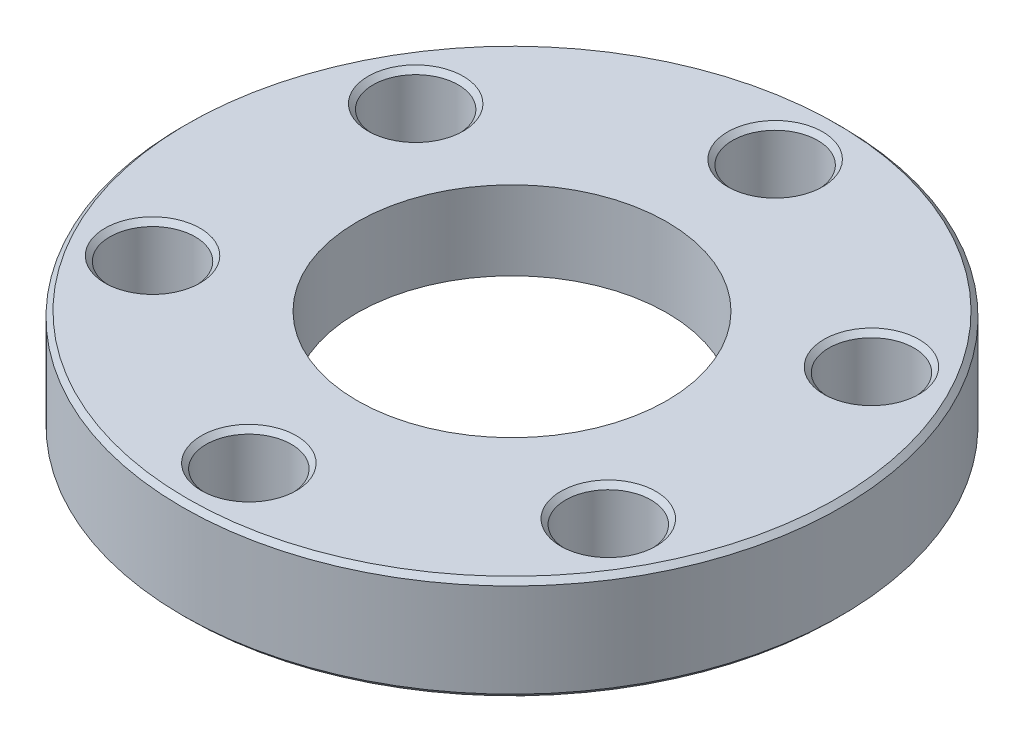
ISO-10303-21;
HEADER;
FILE_DESCRIPTION(('STEP AP214'),'2;1');
FILE_NAME('part.step','',(''),(''),'','','');
FILE_SCHEMA(('AUTOMOTIVE_DESIGN { 1 0 10303 214 1 1 1 1 }'));
ENDSEC;
DATA;
#1=APPLICATION_CONTEXT('core data for automotive mechanical design processes');
#2=APPLICATION_PROTOCOL_DEFINITION('international standard','automotive_design',2000,#1);
#3=PRODUCT_CONTEXT('',#1,'mechanical');
#4=PRODUCT('Part','Part','',(#3));
#5=PRODUCT_RELATED_PRODUCT_CATEGORY('part','',(#4));
#6=PRODUCT_DEFINITION_FORMATION('','',#4);
#7=PRODUCT_DEFINITION_CONTEXT('part definition',#1,'design');
#8=PRODUCT_DEFINITION('design','',#6,#7);
#9=PRODUCT_DEFINITION_SHAPE('','',#8);
#10=(LENGTH_UNIT() NAMED_UNIT(*) SI_UNIT(.MILLI.,.METRE.));
#11=(NAMED_UNIT(*) PLANE_ANGLE_UNIT() SI_UNIT($,.RADIAN.));
#12=(NAMED_UNIT(*) SI_UNIT($,.STERADIAN.) SOLID_ANGLE_UNIT());
#13=UNCERTAINTY_MEASURE_WITH_UNIT(LENGTH_MEASURE(1.E-05),#10,'distance_accuracy_value','');
#14=(GEOMETRIC_REPRESENTATION_CONTEXT(3) GLOBAL_UNCERTAINTY_ASSIGNED_CONTEXT((#13)) GLOBAL_UNIT_ASSIGNED_CONTEXT((#10,
#11,#12)) REPRESENTATION_CONTEXT('',''));
#15=CARTESIAN_POINT('',(0.,0.,0.));
#16=DIRECTION('',(0.,0.,1.));
#17=DIRECTION('',(1.,0.,0.));
#18=AXIS2_PLACEMENT_3D('',#15,#16,#17);
#19=CARTESIAN_POINT('',(0.,12.7,0.));
#20=DIRECTION('',(0.,-1.,0.));
#21=DIRECTION('',(0.,0.,-1.));
#22=AXIS2_PLACEMENT_3D('',#19,#20,#21);
#23=CYLINDRICAL_SURFACE('',#22,16.891);
#24=CARTESIAN_POINT('',(0.,5.05460000000001,0.));
#25=DIRECTION('',(0.,1.,0.));
#26=DIRECTION('',(0.,0.,1.));
#27=AXIS2_PLACEMENT_3D('',#24,#25,#26);
#28=CIRCLE('',#27,16.891);
#29=CARTESIAN_POINT('',(0.,5.05460000000001,16.891));
#30=VERTEX_POINT('',#29);
#31=EDGE_CURVE('E118',#30,#30,#28,.F.);
#32=ORIENTED_EDGE('',*,*,#31,.T.);
#33=EDGE_LOOP('',(#32));
#34=FACE_BOUND('',#33,.T.);
#35=CARTESIAN_POINT('',(0.,0.254000000000001,0.));
#36=DIRECTION('',(0.,1.,0.));
#37=DIRECTION('',(0.,0.,1.));
#38=AXIS2_PLACEMENT_3D('',#35,#36,#37);
#39=CIRCLE('',#38,16.891);
#40=CARTESIAN_POINT('',(0.,0.254000000000001,16.891));
#41=VERTEX_POINT('',#40);
#42=EDGE_CURVE('E121',#41,#41,#39,.T.);
#43=ORIENTED_EDGE('',*,*,#42,.T.);
#44=EDGE_LOOP('',(#43));
#45=FACE_BOUND('',#44,.T.);
#46=ADVANCED_FACE('F30',(#34,#45),#23,.T.);
#47=CARTESIAN_POINT('',(0.,12.7,0.));
#48=DIRECTION('',(0.,-1.,0.));
#49=DIRECTION('',(0.,0.,-1.));
#50=AXIS2_PLACEMENT_3D('',#47,#48,#49);
#51=CYLINDRICAL_SURFACE('',#50,7.9375);
#52=CARTESIAN_POINT('',(0.,1.27,0.));
#53=DIRECTION('',(0.,1.,0.));
#54=DIRECTION('',(0.,0.,1.));
#55=AXIS2_PLACEMENT_3D('',#52,#53,#54);
#56=CIRCLE('',#55,7.9375);
#57=CARTESIAN_POINT('',(0.,1.27,7.9375));
#58=VERTEX_POINT('',#57);
#59=EDGE_CURVE('E111',#58,#58,#56,.T.);
#60=ORIENTED_EDGE('',*,*,#59,.F.);
#61=EDGE_LOOP('',(#60));
#62=FACE_BOUND('',#61,.T.);
#63=CARTESIAN_POINT('',(0.,5.3086,0.));
#64=DIRECTION('',(0.,1.,0.));
#65=DIRECTION('',(0.,0.,1.));
#66=AXIS2_PLACEMENT_3D('',#63,#64,#65);
#67=CIRCLE('',#66,7.9375);
#68=CARTESIAN_POINT('',(0.,5.3086,7.9375));
#69=VERTEX_POINT('',#68);
#70=EDGE_CURVE('E114',#69,#69,#67,.T.);
#71=ORIENTED_EDGE('',*,*,#70,.T.);
#72=EDGE_LOOP('',(#71));
#73=FACE_BOUND('',#72,.T.);
#74=ADVANCED_FACE('F176',(#62,#73),#51,.F.);
#75=CARTESIAN_POINT('',(0.,0.,0.));
#76=DIRECTION('',(0.,1.,0.));
#77=DIRECTION('',(0.,0.,1.));
#78=AXIS2_PLACEMENT_3D('',#75,#76,#77);
#79=PLANE('',#78);
#80=CARTESIAN_POINT('',(-11.6804310310022,0.,-6.74370000000014));
#81=DIRECTION('',(0.,1.,0.));
#82=DIRECTION('',(0.,0.,1.));
#83=AXIS2_PLACEMENT_3D('',#80,#81,#82);
#84=CIRCLE('',#83,2.43839999999997);
#85=CARTESIAN_POINT('',(-11.6804310310022,0.,-4.30530000000017));
#86=VERTEX_POINT('',#85);
#87=EDGE_CURVE('E10',#86,#86,#84,.T.);
#88=ORIENTED_EDGE('',*,*,#87,.T.);
#89=EDGE_LOOP('',(#88));
#90=FACE_BOUND('',#89,.T.);
#91=CARTESIAN_POINT('',(-11.6804310310023,0.,6.74369999999989));
#92=DIRECTION('',(0.,1.,0.));
#93=DIRECTION('',(0.,0.,1.));
#94=AXIS2_PLACEMENT_3D('',#91,#92,#93);
#95=CIRCLE('',#94,2.43839999999997);
#96=CARTESIAN_POINT('',(-11.6804310310023,0.,9.18209999999986));
#97=VERTEX_POINT('',#96);
#98=EDGE_CURVE('E50',#97,#97,#95,.T.);
#99=ORIENTED_EDGE('',*,*,#98,.T.);
#100=EDGE_LOOP('',(#99));
#101=FACE_BOUND('',#100,.T.);
#102=CARTESIAN_POINT('',(0.,0.,13.4874));
#103=DIRECTION('',(0.,1.,0.));
#104=DIRECTION('',(0.,0.,1.));
#105=AXIS2_PLACEMENT_3D('',#102,#103,#104);
#106=CIRCLE('',#105,2.43839999999998);
#107=CARTESIAN_POINT('',(0.,0.,15.9258));
#108=VERTEX_POINT('',#107);
#109=EDGE_CURVE('E62',#108,#108,#106,.T.);
#110=ORIENTED_EDGE('',*,*,#109,.T.);
#111=EDGE_LOOP('',(#110));
#112=FACE_BOUND('',#111,.T.);
#113=CARTESIAN_POINT('',(11.6804310310022,0.,6.74370000000006));
#114=DIRECTION('',(0.,1.,0.));
#115=DIRECTION('',(0.,0.,1.));
#116=AXIS2_PLACEMENT_3D('',#113,#114,#115);
#117=CIRCLE('',#116,2.43839999999998);
#118=CARTESIAN_POINT('',(11.6804310310022,0.,9.18210000000003));
#119=VERTEX_POINT('',#118);
#120=EDGE_CURVE('E74',#119,#119,#117,.T.);
#121=ORIENTED_EDGE('',*,*,#120,.T.);
#122=EDGE_LOOP('',(#121));
#123=FACE_BOUND('',#122,.T.);
#124=CARTESIAN_POINT('',(11.6804310310023,0.,-6.74369999999997));
#125=DIRECTION('',(0.,1.,0.));
#126=DIRECTION('',(0.,0.,1.));
#127=AXIS2_PLACEMENT_3D('',#124,#125,#126);
#128=CIRCLE('',#127,2.43839999999997);
#129=CARTESIAN_POINT('',(11.6804310310023,0.,-4.3053));
#130=VERTEX_POINT('',#129);
#131=EDGE_CURVE('E86',#130,#130,#128,.T.);
#132=ORIENTED_EDGE('',*,*,#131,.T.);
#133=EDGE_LOOP('',(#132));
#134=FACE_BOUND('',#133,.T.);
#135=CARTESIAN_POINT('',(0.,0.,-13.4874));
#136=DIRECTION('',(0.,1.,0.));
#137=DIRECTION('',(0.,0.,1.));
#138=AXIS2_PLACEMENT_3D('',#135,#136,#137);
#139=CIRCLE('',#138,2.43839999999998);
#140=CARTESIAN_POINT('',(0.,0.,-11.049));
#141=VERTEX_POINT('',#140);
#142=EDGE_CURVE('E98',#141,#141,#139,.T.);
#143=ORIENTED_EDGE('',*,*,#142,.T.);
#144=EDGE_LOOP('',(#143));
#145=FACE_BOUND('',#144,.T.);
#146=CARTESIAN_POINT('',(0.,0.,0.));
#147=DIRECTION('',(0.,1.,0.));
#148=DIRECTION('',(0.,0.,1.));
#149=AXIS2_PLACEMENT_3D('',#146,#147,#148);
#150=CIRCLE('',#149,10.7188);
#151=CARTESIAN_POINT('',(0.,0.,10.7188));
#152=VERTEX_POINT('',#151);
#153=EDGE_CURVE('E137',#152,#152,#150,.T.);
#154=ORIENTED_EDGE('',*,*,#153,.T.);
#155=EDGE_LOOP('',(#154));
#156=FACE_BOUND('',#155,.T.);
#157=CARTESIAN_POINT('',(0.,0.,0.));
#158=DIRECTION('',(0.,1.,0.));
#159=DIRECTION('',(0.,0.,1.));
#160=AXIS2_PLACEMENT_3D('',#157,#158,#159);
#161=CIRCLE('',#160,16.637);
#162=CARTESIAN_POINT('',(0.,0.,16.637));
#163=VERTEX_POINT('',#162);
#164=EDGE_CURVE('E110',#163,#163,#161,.F.);
#165=ORIENTED_EDGE('',*,*,#164,.T.);
#166=EDGE_LOOP('',(#165));
#167=FACE_BOUND('',#166,.T.);
#168=ADVANCED_FACE('F141',(#90,#101,#112,#123,#134,#145,#156,#167),#79,.F.);
#169=CARTESIAN_POINT('',(0.,5.3086,0.));
#170=DIRECTION('',(0.,1.,0.));
#171=DIRECTION('',(0.,0.,1.));
#172=AXIS2_PLACEMENT_3D('',#169,#170,#171);
#173=PLANE('',#172);
#174=CARTESIAN_POINT('',(-11.6804310310022,5.3086,-6.74370000000014));
#175=DIRECTION('',(0.,1.,0.));
#176=DIRECTION('',(0.,0.,1.));
#177=AXIS2_PLACEMENT_3D('',#174,#175,#176);
#178=CIRCLE('',#177,2.43840000000002);
#179=CARTESIAN_POINT('',(-11.6804310310022,5.3086,-4.30530000000011));
#180=VERTEX_POINT('',#179);
#181=EDGE_CURVE('E37',#180,#180,#178,.F.);
#182=ORIENTED_EDGE('',*,*,#181,.T.);
#183=EDGE_LOOP('',(#182));
#184=FACE_BOUND('',#183,.T.);
#185=CARTESIAN_POINT('',(-11.6804310310023,5.3086,6.74369999999989));
#186=DIRECTION('',(0.,1.,0.));
#187=DIRECTION('',(0.,0.,1.));
#188=AXIS2_PLACEMENT_3D('',#185,#186,#187);
#189=CIRCLE('',#188,2.43840000000002);
#190=CARTESIAN_POINT('',(-11.6804310310023,5.3086,9.18209999999991));
#191=VERTEX_POINT('',#190);
#192=EDGE_CURVE('E53',#191,#191,#189,.F.);
#193=ORIENTED_EDGE('',*,*,#192,.T.);
#194=EDGE_LOOP('',(#193));
#195=FACE_BOUND('',#194,.T.);
#196=CARTESIAN_POINT('',(0.,5.3086,13.4874));
#197=DIRECTION('',(0.,1.,0.));
#198=DIRECTION('',(0.,0.,1.));
#199=AXIS2_PLACEMENT_3D('',#196,#197,#198);
#200=CIRCLE('',#199,2.43840000000001);
#201=CARTESIAN_POINT('',(0.,5.3086,15.9258));
#202=VERTEX_POINT('',#201);
#203=EDGE_CURVE('E65',#202,#202,#200,.F.);
#204=ORIENTED_EDGE('',*,*,#203,.T.);
#205=EDGE_LOOP('',(#204));
#206=FACE_BOUND('',#205,.T.);
#207=CARTESIAN_POINT('',(11.6804310310022,5.3086,6.74370000000006));
#208=DIRECTION('',(0.,1.,0.));
#209=DIRECTION('',(0.,0.,1.));
#210=AXIS2_PLACEMENT_3D('',#207,#208,#209);
#211=CIRCLE('',#210,2.43840000000003);
#212=CARTESIAN_POINT('',(11.6804310310022,5.3086,9.18210000000009));
#213=VERTEX_POINT('',#212);
#214=EDGE_CURVE('E77',#213,#213,#211,.F.);
#215=ORIENTED_EDGE('',*,*,#214,.T.);
#216=EDGE_LOOP('',(#215));
#217=FACE_BOUND('',#216,.T.);
#218=CARTESIAN_POINT('',(11.6804310310023,5.3086,-6.74369999999997));
#219=DIRECTION('',(0.,1.,0.));
#220=DIRECTION('',(0.,0.,1.));
#221=AXIS2_PLACEMENT_3D('',#218,#219,#220);
#222=CIRCLE('',#221,2.43840000000002);
#223=CARTESIAN_POINT('',(11.6804310310023,5.3086,-4.30529999999995));
#224=VERTEX_POINT('',#223);
#225=EDGE_CURVE('E89',#224,#224,#222,.F.);
#226=ORIENTED_EDGE('',*,*,#225,.T.);
#227=EDGE_LOOP('',(#226));
#228=FACE_BOUND('',#227,.T.);
#229=CARTESIAN_POINT('',(0.,5.3086,-13.4874));
#230=DIRECTION('',(0.,1.,0.));
#231=DIRECTION('',(0.,0.,1.));
#232=AXIS2_PLACEMENT_3D('',#229,#230,#231);
#233=CIRCLE('',#232,2.43840000000001);
#234=CARTESIAN_POINT('',(0.,5.3086,-11.049));
#235=VERTEX_POINT('',#234);
#236=EDGE_CURVE('E101',#235,#235,#233,.F.);
#237=ORIENTED_EDGE('',*,*,#236,.T.);
#238=EDGE_LOOP('',(#237));
#239=FACE_BOUND('',#238,.T.);
#240=CARTESIAN_POINT('',(0.,5.3086,0.));
#241=DIRECTION('',(0.,1.,0.));
#242=DIRECTION('',(0.,0.,1.));
#243=AXIS2_PLACEMENT_3D('',#240,#241,#242);
#244=CIRCLE('',#243,16.637);
#245=CARTESIAN_POINT('',(0.,5.3086,16.637));
#246=VERTEX_POINT('',#245);
#247=EDGE_CURVE('E124',#246,#246,#244,.T.);
#248=ORIENTED_EDGE('',*,*,#247,.T.);
#249=EDGE_LOOP('',(#248));
#250=FACE_BOUND('',#249,.T.);
#251=ORIENTED_EDGE('',*,*,#70,.F.);
#252=EDGE_LOOP('',(#251));
#253=FACE_BOUND('',#252,.T.);
#254=ADVANCED_FACE('F188',(#184,#195,#206,#217,#228,#239,#250,#253),#173,.T.);
#255=CARTESIAN_POINT('',(0.,5.3086,0.));
#256=DIRECTION('',(0.,-1.,0.));
#257=DIRECTION('',(0.,0.,-1.));
#258=AXIS2_PLACEMENT_3D('',#255,#256,#257);
#259=CONICAL_SURFACE('',#258,16.637,0.785398163397455);
#260=ORIENTED_EDGE('',*,*,#31,.F.);
#261=EDGE_LOOP('',(#260));
#262=FACE_BOUND('',#261,.T.);
#263=ORIENTED_EDGE('',*,*,#247,.F.);
#264=EDGE_LOOP('',(#263));
#265=FACE_BOUND('',#264,.T.);
#266=ADVANCED_FACE('F171',(#262,#265),#259,.T.);
#267=CARTESIAN_POINT('',(0.,0.254000000000001,0.));
#268=DIRECTION('',(0.,1.,0.));
#269=DIRECTION('',(0.,0.,1.));
#270=AXIS2_PLACEMENT_3D('',#267,#268,#269);
#271=CONICAL_SURFACE('',#270,16.891,0.785398163397448);
#272=ORIENTED_EDGE('',*,*,#164,.F.);
#273=EDGE_LOOP('',(#272));
#274=FACE_BOUND('',#273,.T.);
#275=ORIENTED_EDGE('',*,*,#42,.F.);
#276=EDGE_LOOP('',(#275));
#277=FACE_BOUND('',#276,.T.);
#278=ADVANCED_FACE('F165',(#274,#277),#271,.T.);
#279=CARTESIAN_POINT('',(-9.144,1.27,0.));
#280=DIRECTION('',(0.,1.,0.));
#281=DIRECTION('',(0.,0.,1.));
#282=AXIS2_PLACEMENT_3D('',#279,#280,#281);
#283=PLANE('',#282);
#284=ORIENTED_EDGE('',*,*,#59,.T.);
#285=EDGE_LOOP('',(#284));
#286=FACE_BOUND('',#285,.T.);
#287=CARTESIAN_POINT('',(0.,1.27,0.));
#288=DIRECTION('',(0.,1.,0.));
#289=DIRECTION('',(0.,0.,1.));
#290=AXIS2_PLACEMENT_3D('',#287,#288,#289);
#291=CIRCLE('',#290,9.144);
#292=CARTESIAN_POINT('',(0.,1.27,9.144));
#293=VERTEX_POINT('',#292);
#294=EDGE_CURVE('E115',#293,#293,#291,.T.);
#295=ORIENTED_EDGE('',*,*,#294,.F.);
#296=EDGE_LOOP('',(#295));
#297=FACE_BOUND('',#296,.T.);
#298=ADVANCED_FACE('F160',(#286,#297),#283,.F.);
#299=CARTESIAN_POINT('',(0.,5.3086,0.));
#300=DIRECTION('',(0.,1.,0.));
#301=DIRECTION('',(0.,0.,1.));
#302=AXIS2_PLACEMENT_3D('',#299,#300,#301);
#303=CYLINDRICAL_SURFACE('',#302,9.144);
#304=CARTESIAN_POINT('',(0.,0.6604,0.));
#305=DIRECTION('',(0.,1.,0.));
#306=DIRECTION('',(0.,0.,1.));
#307=AXIS2_PLACEMENT_3D('',#304,#305,#306);
#308=CIRCLE('',#307,9.144);
#309=CARTESIAN_POINT('',(0.,0.6604,9.144));
#310=VERTEX_POINT('',#309);
#311=EDGE_CURVE('E131',#310,#310,#308,.T.);
#312=ORIENTED_EDGE('',*,*,#311,.F.);
#313=EDGE_LOOP('',(#312));
#314=FACE_BOUND('',#313,.T.);
#315=ORIENTED_EDGE('',*,*,#294,.T.);
#316=EDGE_LOOP('',(#315));
#317=FACE_BOUND('',#316,.T.);
#318=ADVANCED_FACE('F154',(#314,#317),#303,.F.);
#319=CARTESIAN_POINT('',(0.,0.6604,0.));
#320=DIRECTION('',(0.,1.,0.));
#321=DIRECTION('',(0.,0.,1.));
#322=AXIS2_PLACEMENT_3D('',#319,#320,#321);
#323=CONICAL_SURFACE('',#322,9.144,1.21556546474821);
#324=CARTESIAN_POINT('',(0.,1.2446,0.));
#325=DIRECTION('',(0.,1.,0.));
#326=DIRECTION('',(0.,0.,1.));
#327=AXIS2_PLACEMENT_3D('',#324,#325,#326);
#328=CIRCLE('',#327,10.7188);
#329=CARTESIAN_POINT('',(0.,1.2446,10.7188));
#330=VERTEX_POINT('',#329);
#331=EDGE_CURVE('E134',#330,#330,#328,.T.);
#332=ORIENTED_EDGE('',*,*,#331,.F.);
#333=EDGE_LOOP('',(#332));
#334=FACE_BOUND('',#333,.T.);
#335=ORIENTED_EDGE('',*,*,#311,.T.);
#336=EDGE_LOOP('',(#335));
#337=FACE_BOUND('',#336,.T.);
#338=ADVANCED_FACE('F148',(#334,#337),#323,.T.);
#339=CARTESIAN_POINT('',(0.,5.3086,0.));
#340=DIRECTION('',(0.,1.,0.));
#341=DIRECTION('',(0.,0.,1.));
#342=AXIS2_PLACEMENT_3D('',#339,#340,#341);
#343=CYLINDRICAL_SURFACE('',#342,10.7188);
#344=ORIENTED_EDGE('',*,*,#153,.F.);
#345=EDGE_LOOP('',(#344));
#346=FACE_BOUND('',#345,.T.);
#347=ORIENTED_EDGE('',*,*,#331,.T.);
#348=EDGE_LOOP('',(#347));
#349=FACE_BOUND('',#348,.T.);
#350=ADVANCED_FACE('F144',(#346,#349),#343,.F.);
#351=CARTESIAN_POINT('',(0.,0.,-13.4874));
#352=DIRECTION('',(0.,1.,0.));
#353=DIRECTION('',(0.,0.,1.));
#354=AXIS2_PLACEMENT_3D('',#351,#352,#353);
#355=CYLINDRICAL_SURFACE('',#354,2.1844);
#356=CARTESIAN_POINT('',(0.,5.05459999999999,-13.4874));
#357=DIRECTION('',(0.,1.,0.));
#358=DIRECTION('',(0.,0.,1.));
#359=AXIS2_PLACEMENT_3D('',#356,#357,#358);
#360=CIRCLE('',#359,2.1844);
#361=CARTESIAN_POINT('',(0.,5.05459999999999,-11.303));
#362=VERTEX_POINT('',#361);
#363=EDGE_CURVE('E104',#362,#362,#360,.T.);
#364=ORIENTED_EDGE('',*,*,#363,.T.);
#365=EDGE_LOOP('',(#364));
#366=FACE_BOUND('',#365,.T.);
#367=CARTESIAN_POINT('',(0.,0.25399999999998,-13.4874));
#368=DIRECTION('',(0.,1.,0.));
#369=DIRECTION('',(0.,0.,1.));
#370=AXIS2_PLACEMENT_3D('',#367,#368,#369);
#371=CIRCLE('',#370,2.1844);
#372=CARTESIAN_POINT('',(0.,0.25399999999998,-11.303));
#373=VERTEX_POINT('',#372);
#374=EDGE_CURVE('E107',#373,#373,#371,.F.);
#375=ORIENTED_EDGE('',*,*,#374,.T.);
#376=EDGE_LOOP('',(#375));
#377=FACE_BOUND('',#376,.T.);
#378=ADVANCED_FACE('F147',(#366,#377),#355,.F.);
#379=CARTESIAN_POINT('',(0.,5.05459999999999,-13.4874));
#380=DIRECTION('',(0.,1.,0.));
#381=DIRECTION('',(0.,0.,1.));
#382=AXIS2_PLACEMENT_3D('',#379,#380,#381);
#383=CONICAL_SURFACE('',#382,2.1844,0.785398163397448);
#384=ORIENTED_EDGE('',*,*,#236,.F.);
#385=EDGE_LOOP('',(#384));
#386=FACE_BOUND('',#385,.T.);
#387=ORIENTED_EDGE('',*,*,#363,.F.);
#388=EDGE_LOOP('',(#387));
#389=FACE_BOUND('',#388,.T.);
#390=ADVANCED_FACE('F191',(#386,#389),#383,.F.);
#391=CARTESIAN_POINT('',(0.,0.,-13.4874));
#392=DIRECTION('',(0.,-1.,0.));
#393=DIRECTION('',(0.,0.,-1.));
#394=AXIS2_PLACEMENT_3D('',#391,#392,#393);
#395=CONICAL_SURFACE('',#394,2.43839999999998,0.785398163397448);
#396=ORIENTED_EDGE('',*,*,#374,.F.);
#397=EDGE_LOOP('',(#396));
#398=FACE_BOUND('',#397,.T.);
#399=ORIENTED_EDGE('',*,*,#142,.F.);
#400=EDGE_LOOP('',(#399));
#401=FACE_BOUND('',#400,.T.);
#402=ADVANCED_FACE('F194',(#398,#401),#395,.F.);
#403=CARTESIAN_POINT('',(11.6804310310023,0.,-6.74369999999997));
#404=DIRECTION('',(0.,1.,0.));
#405=DIRECTION('',(0.,0.,1.));
#406=AXIS2_PLACEMENT_3D('',#403,#404,#405);
#407=CYLINDRICAL_SURFACE('',#406,2.1844);
#408=CARTESIAN_POINT('',(11.6804310310023,5.05459999999998,-6.74369999999997));
#409=DIRECTION('',(0.,1.,0.));
#410=DIRECTION('',(0.,0.,1.));
#411=AXIS2_PLACEMENT_3D('',#408,#409,#410);
#412=CIRCLE('',#411,2.1844);
#413=CARTESIAN_POINT('',(11.6804310310023,5.05459999999998,-4.55929999999997));
#414=VERTEX_POINT('',#413);
#415=EDGE_CURVE('E92',#414,#414,#412,.T.);
#416=ORIENTED_EDGE('',*,*,#415,.T.);
#417=EDGE_LOOP('',(#416));
#418=FACE_BOUND('',#417,.T.);
#419=CARTESIAN_POINT('',(11.6804310310023,0.253999999999966,-6.74369999999997));
#420=DIRECTION('',(0.,1.,0.));
#421=DIRECTION('',(0.,0.,1.));
#422=AXIS2_PLACEMENT_3D('',#419,#420,#421);
#423=CIRCLE('',#422,2.1844);
#424=CARTESIAN_POINT('',(11.6804310310023,0.253999999999966,-4.55929999999997));
#425=VERTEX_POINT('',#424);
#426=EDGE_CURVE('E95',#425,#425,#423,.F.);
#427=ORIENTED_EDGE('',*,*,#426,.T.);
#428=EDGE_LOOP('',(#427));
#429=FACE_BOUND('',#428,.T.);
#430=ADVANCED_FACE('F198',(#418,#429),#407,.F.);
#431=CARTESIAN_POINT('',(11.6804310310022,0.,6.74370000000006));
#432=DIRECTION('',(0.,1.,0.));
#433=DIRECTION('',(0.,0.,1.));
#434=AXIS2_PLACEMENT_3D('',#431,#432,#433);
#435=CYLINDRICAL_SURFACE('',#434,2.1844);
#436=CARTESIAN_POINT('',(11.6804310310022,5.05459999999997,6.74370000000006));
#437=DIRECTION('',(0.,1.,0.));
#438=DIRECTION('',(0.,0.,1.));
#439=AXIS2_PLACEMENT_3D('',#436,#437,#438);
#440=CIRCLE('',#439,2.1844);
#441=CARTESIAN_POINT('',(11.6804310310022,5.05459999999997,8.92810000000006));
#442=VERTEX_POINT('',#441);
#443=EDGE_CURVE('E80',#442,#442,#440,.T.);
#444=ORIENTED_EDGE('',*,*,#443,.T.);
#445=EDGE_LOOP('',(#444));
#446=FACE_BOUND('',#445,.T.);
#447=CARTESIAN_POINT('',(11.6804310310022,0.25399999999998,6.74370000000006));
#448=DIRECTION('',(0.,1.,0.));
#449=DIRECTION('',(0.,0.,1.));
#450=AXIS2_PLACEMENT_3D('',#447,#448,#449);
#451=CIRCLE('',#450,2.1844);
#452=CARTESIAN_POINT('',(11.6804310310022,0.25399999999998,8.92810000000006));
#453=VERTEX_POINT('',#452);
#454=EDGE_CURVE('E83',#453,#453,#451,.F.);
#455=ORIENTED_EDGE('',*,*,#454,.T.);
#456=EDGE_LOOP('',(#455));
#457=FACE_BOUND('',#456,.T.);
#458=ADVANCED_FACE('F257',(#446,#457),#435,.F.);
#459=CARTESIAN_POINT('',(0.,0.,13.4874));
#460=DIRECTION('',(0.,1.,0.));
#461=DIRECTION('',(0.,0.,1.));
#462=AXIS2_PLACEMENT_3D('',#459,#460,#461);
#463=CYLINDRICAL_SURFACE('',#462,2.1844);
#464=CARTESIAN_POINT('',(0.,5.05459999999999,13.4874));
#465=DIRECTION('',(0.,1.,0.));
#466=DIRECTION('',(0.,0.,1.));
#467=AXIS2_PLACEMENT_3D('',#464,#465,#466);
#468=CIRCLE('',#467,2.1844);
#469=CARTESIAN_POINT('',(0.,5.05459999999999,15.6718));
#470=VERTEX_POINT('',#469);
#471=EDGE_CURVE('E68',#470,#470,#468,.T.);
#472=ORIENTED_EDGE('',*,*,#471,.T.);
#473=EDGE_LOOP('',(#472));
#474=FACE_BOUND('',#473,.T.);
#475=CARTESIAN_POINT('',(0.,0.25399999999998,13.4874));
#476=DIRECTION('',(0.,1.,0.));
#477=DIRECTION('',(0.,0.,1.));
#478=AXIS2_PLACEMENT_3D('',#475,#476,#477);
#479=CIRCLE('',#478,2.1844);
#480=CARTESIAN_POINT('',(0.,0.25399999999998,15.6718));
#481=VERTEX_POINT('',#480);
#482=EDGE_CURVE('E71',#481,#481,#479,.F.);
#483=ORIENTED_EDGE('',*,*,#482,.T.);
#484=EDGE_LOOP('',(#483));
#485=FACE_BOUND('',#484,.T.);
#486=ADVANCED_FACE('F251',(#474,#485),#463,.F.);
#487=CARTESIAN_POINT('',(-11.6804310310023,0.,6.74369999999989));
#488=DIRECTION('',(0.,1.,0.));
#489=DIRECTION('',(0.,0.,1.));
#490=AXIS2_PLACEMENT_3D('',#487,#488,#489);
#491=CYLINDRICAL_SURFACE('',#490,2.1844);
#492=CARTESIAN_POINT('',(-11.6804310310023,5.05459999999998,6.74369999999989));
#493=DIRECTION('',(0.,1.,0.));
#494=DIRECTION('',(0.,0.,1.));
#495=AXIS2_PLACEMENT_3D('',#492,#493,#494);
#496=CIRCLE('',#495,2.1844);
#497=CARTESIAN_POINT('',(-11.6804310310023,5.05459999999998,8.92809999999989));
#498=VERTEX_POINT('',#497);
#499=EDGE_CURVE('E56',#498,#498,#496,.T.);
#500=ORIENTED_EDGE('',*,*,#499,.T.);
#501=EDGE_LOOP('',(#500));
#502=FACE_BOUND('',#501,.T.);
#503=CARTESIAN_POINT('',(-11.6804310310023,0.253999999999966,6.74369999999989));
#504=DIRECTION('',(0.,1.,0.));
#505=DIRECTION('',(0.,0.,1.));
#506=AXIS2_PLACEMENT_3D('',#503,#504,#505);
#507=CIRCLE('',#506,2.1844);
#508=CARTESIAN_POINT('',(-11.6804310310023,0.253999999999966,8.92809999999989));
#509=VERTEX_POINT('',#508);
#510=EDGE_CURVE('E59',#509,#509,#507,.F.);
#511=ORIENTED_EDGE('',*,*,#510,.T.);
#512=EDGE_LOOP('',(#511));
#513=FACE_BOUND('',#512,.T.);
#514=ADVANCED_FACE('F244',(#502,#513),#491,.F.);
#515=CARTESIAN_POINT('',(-11.6804310310022,0.,-6.74370000000014));
#516=DIRECTION('',(0.,1.,0.));
#517=DIRECTION('',(0.,0.,1.));
#518=AXIS2_PLACEMENT_3D('',#515,#516,#517);
#519=CYLINDRICAL_SURFACE('',#518,2.1844);
#520=CARTESIAN_POINT('',(-11.6804310310022,5.05459999999998,-6.74370000000014));
#521=DIRECTION('',(0.,1.,0.));
#522=DIRECTION('',(0.,0.,1.));
#523=AXIS2_PLACEMENT_3D('',#520,#521,#522);
#524=CIRCLE('',#523,2.1844);
#525=CARTESIAN_POINT('',(-11.6804310310022,5.05459999999998,-4.55930000000014));
#526=VERTEX_POINT('',#525);
#527=EDGE_CURVE('E41',#526,#526,#524,.T.);
#528=ORIENTED_EDGE('',*,*,#527,.T.);
#529=EDGE_LOOP('',(#528));
#530=FACE_BOUND('',#529,.T.);
#531=CARTESIAN_POINT('',(-11.6804310310022,0.253999999999966,-6.74370000000014));
#532=DIRECTION('',(0.,1.,0.));
#533=DIRECTION('',(0.,0.,1.));
#534=AXIS2_PLACEMENT_3D('',#531,#532,#533);
#535=CIRCLE('',#534,2.1844);
#536=CARTESIAN_POINT('',(-11.6804310310022,0.253999999999966,-4.55930000000014));
#537=VERTEX_POINT('',#536);
#538=EDGE_CURVE('E45',#537,#537,#535,.F.);
#539=ORIENTED_EDGE('',*,*,#538,.T.);
#540=EDGE_LOOP('',(#539));
#541=FACE_BOUND('',#540,.T.);
#542=ADVANCED_FACE('F204',(#530,#541),#519,.F.);
#543=CARTESIAN_POINT('',(11.6804310310023,5.05459999999998,-6.74369999999997));
#544=DIRECTION('',(0.,1.,0.));
#545=DIRECTION('',(0.,0.,1.));
#546=AXIS2_PLACEMENT_3D('',#543,#544,#545);
#547=CONICAL_SURFACE('',#546,2.1844,0.785398163397447);
#548=ORIENTED_EDGE('',*,*,#225,.F.);
#549=EDGE_LOOP('',(#548));
#550=FACE_BOUND('',#549,.T.);
#551=ORIENTED_EDGE('',*,*,#415,.F.);
#552=EDGE_LOOP('',(#551));
#553=FACE_BOUND('',#552,.T.);
#554=ADVANCED_FACE('F200',(#550,#553),#547,.F.);
#555=CARTESIAN_POINT('',(11.6804310310023,0.,-6.74369999999997));
#556=DIRECTION('',(0.,-1.,0.));
#557=DIRECTION('',(0.,0.,-1.));
#558=AXIS2_PLACEMENT_3D('',#555,#556,#557);
#559=CONICAL_SURFACE('',#558,2.43839999999997,0.785398163397456);
#560=ORIENTED_EDGE('',*,*,#426,.F.);
#561=EDGE_LOOP('',(#560));
#562=FACE_BOUND('',#561,.T.);
#563=ORIENTED_EDGE('',*,*,#131,.F.);
#564=EDGE_LOOP('',(#563));
#565=FACE_BOUND('',#564,.T.);
#566=ADVANCED_FACE('F203',(#562,#565),#559,.F.);
#567=CARTESIAN_POINT('',(11.6804310310022,5.05459999999997,6.74370000000006));
#568=DIRECTION('',(0.,1.,0.));
#569=DIRECTION('',(0.,0.,1.));
#570=AXIS2_PLACEMENT_3D('',#567,#568,#569);
#571=CONICAL_SURFACE('',#570,2.1844,0.785398163397448);
#572=ORIENTED_EDGE('',*,*,#214,.F.);
#573=EDGE_LOOP('',(#572));
#574=FACE_BOUND('',#573,.T.);
#575=ORIENTED_EDGE('',*,*,#443,.F.);
#576=EDGE_LOOP('',(#575));
#577=FACE_BOUND('',#576,.T.);
#578=ADVANCED_FACE('F208',(#574,#577),#571,.F.);
#579=CARTESIAN_POINT('',(11.6804310310022,0.,6.74370000000006));
#580=DIRECTION('',(0.,-1.,0.));
#581=DIRECTION('',(0.,0.,-1.));
#582=AXIS2_PLACEMENT_3D('',#579,#580,#581);
#583=CONICAL_SURFACE('',#582,2.43839999999998,0.785398163397447);
#584=ORIENTED_EDGE('',*,*,#454,.F.);
#585=EDGE_LOOP('',(#584));
#586=FACE_BOUND('',#585,.T.);
#587=ORIENTED_EDGE('',*,*,#120,.F.);
#588=EDGE_LOOP('',(#587));
#589=FACE_BOUND('',#588,.T.);
#590=ADVANCED_FACE('F212',(#586,#589),#583,.F.);
#591=CARTESIAN_POINT('',(0.,5.05459999999999,13.4874));
#592=DIRECTION('',(0.,1.,0.));
#593=DIRECTION('',(0.,0.,1.));
#594=AXIS2_PLACEMENT_3D('',#591,#592,#593);
#595=CONICAL_SURFACE('',#594,2.1844,0.785398163397448);
#596=ORIENTED_EDGE('',*,*,#203,.F.);
#597=EDGE_LOOP('',(#596));
#598=FACE_BOUND('',#597,.T.);
#599=ORIENTED_EDGE('',*,*,#471,.F.);
#600=EDGE_LOOP('',(#599));
#601=FACE_BOUND('',#600,.T.);
#602=ADVANCED_FACE('F216',(#598,#601),#595,.F.);
#603=CARTESIAN_POINT('',(0.,0.,13.4874));
#604=DIRECTION('',(0.,-1.,0.));
#605=DIRECTION('',(0.,0.,-1.));
#606=AXIS2_PLACEMENT_3D('',#603,#604,#605);
#607=CONICAL_SURFACE('',#606,2.43839999999998,0.785398163397448);
#608=ORIENTED_EDGE('',*,*,#482,.F.);
#609=EDGE_LOOP('',(#608));
#610=FACE_BOUND('',#609,.T.);
#611=ORIENTED_EDGE('',*,*,#109,.F.);
#612=EDGE_LOOP('',(#611));
#613=FACE_BOUND('',#612,.T.);
#614=ADVANCED_FACE('F220',(#610,#613),#607,.F.);
#615=CARTESIAN_POINT('',(-11.6804310310023,5.05459999999998,6.74369999999989));
#616=DIRECTION('',(0.,1.,0.));
#617=DIRECTION('',(0.,0.,1.));
#618=AXIS2_PLACEMENT_3D('',#615,#616,#617);
#619=CONICAL_SURFACE('',#618,2.1844,0.785398163397448);
#620=ORIENTED_EDGE('',*,*,#192,.F.);
#621=EDGE_LOOP('',(#620));
#622=FACE_BOUND('',#621,.T.);
#623=ORIENTED_EDGE('',*,*,#499,.F.);
#624=EDGE_LOOP('',(#623));
#625=FACE_BOUND('',#624,.T.);
#626=ADVANCED_FACE('F224',(#622,#625),#619,.F.);
#627=CARTESIAN_POINT('',(-11.6804310310023,0.,6.74369999999989));
#628=DIRECTION('',(0.,-1.,0.));
#629=DIRECTION('',(0.,0.,-1.));
#630=AXIS2_PLACEMENT_3D('',#627,#628,#629);
#631=CONICAL_SURFACE('',#630,2.43839999999997,0.785398163397451);
#632=ORIENTED_EDGE('',*,*,#510,.F.);
#633=EDGE_LOOP('',(#632));
#634=FACE_BOUND('',#633,.T.);
#635=ORIENTED_EDGE('',*,*,#98,.F.);
#636=EDGE_LOOP('',(#635));
#637=FACE_BOUND('',#636,.T.);
#638=ADVANCED_FACE('F228',(#634,#637),#631,.F.);
#639=CARTESIAN_POINT('',(-11.6804310310022,5.05459999999998,-6.74370000000014));
#640=DIRECTION('',(0.,1.,0.));
#641=DIRECTION('',(0.,0.,1.));
#642=AXIS2_PLACEMENT_3D('',#639,#640,#641);
#643=CONICAL_SURFACE('',#642,2.1844,0.78539816339745);
#644=ORIENTED_EDGE('',*,*,#181,.F.);
#645=EDGE_LOOP('',(#644));
#646=FACE_BOUND('',#645,.T.);
#647=ORIENTED_EDGE('',*,*,#527,.F.);
#648=EDGE_LOOP('',(#647));
#649=FACE_BOUND('',#648,.T.);
#650=ADVANCED_FACE('F231',(#646,#649),#643,.F.);
#651=CARTESIAN_POINT('',(-11.6804310310022,0.,-6.74370000000014));
#652=DIRECTION('',(0.,-1.,0.));
#653=DIRECTION('',(0.,0.,-1.));
#654=AXIS2_PLACEMENT_3D('',#651,#652,#653);
#655=CONICAL_SURFACE('',#654,2.43839999999997,0.785398163397456);
#656=ORIENTED_EDGE('',*,*,#538,.F.);
#657=EDGE_LOOP('',(#656));
#658=FACE_BOUND('',#657,.T.);
#659=ORIENTED_EDGE('',*,*,#87,.F.);
#660=EDGE_LOOP('',(#659));
#661=FACE_BOUND('',#660,.T.);
#662=ADVANCED_FACE('F32',(#658,#661),#655,.F.);
#663=CLOSED_SHELL('',(#46,#74,#168,#254,#266,#278,#298,#318,#338,#350,#378,#390,#402,#430,#458,
#486,#514,#542,#554,#566,#578,#590,#602,#614,#626,#638,#650,#662));
#664=MANIFOLD_SOLID_BREP('B2',#663);
#665=ADVANCED_BREP_SHAPE_REPRESENTATION('',(#18,#664),#14);
#666=SHAPE_DEFINITION_REPRESENTATION(#9,#665);
ENDSEC;
END-ISO-10303-21;
